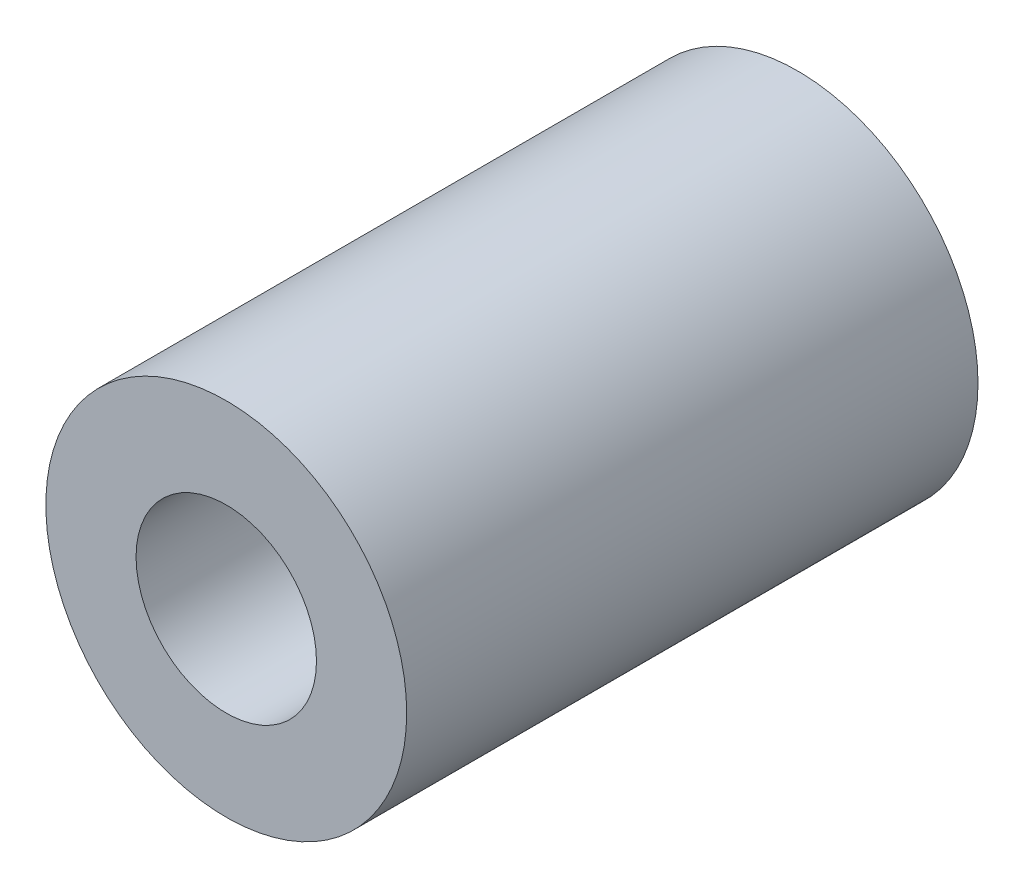
ISO-10303-21;
HEADER;
FILE_DESCRIPTION(('STEP AP214'),'2;1');
FILE_NAME('part.step','',(''),(''),'','','');
FILE_SCHEMA(('AUTOMOTIVE_DESIGN { 1 0 10303 214 1 1 1 1 }'));
ENDSEC;
DATA;
#1=APPLICATION_CONTEXT('core data for automotive mechanical design processes');
#2=APPLICATION_PROTOCOL_DEFINITION('international standard','automotive_design',2000,#1);
#3=PRODUCT_CONTEXT('',#1,'mechanical');
#4=PRODUCT('Part','Part','',(#3));
#5=PRODUCT_RELATED_PRODUCT_CATEGORY('part','',(#4));
#6=PRODUCT_DEFINITION_FORMATION('','',#4);
#7=PRODUCT_DEFINITION_CONTEXT('part definition',#1,'design');
#8=PRODUCT_DEFINITION('design','',#6,#7);
#9=PRODUCT_DEFINITION_SHAPE('','',#8);
#10=(LENGTH_UNIT() NAMED_UNIT(*) SI_UNIT(.MILLI.,.METRE.));
#11=(NAMED_UNIT(*) PLANE_ANGLE_UNIT() SI_UNIT($,.RADIAN.));
#12=(NAMED_UNIT(*) SI_UNIT($,.STERADIAN.) SOLID_ANGLE_UNIT());
#13=UNCERTAINTY_MEASURE_WITH_UNIT(LENGTH_MEASURE(1.E-05),#10,'distance_accuracy_value','');
#14=(GEOMETRIC_REPRESENTATION_CONTEXT(3) GLOBAL_UNCERTAINTY_ASSIGNED_CONTEXT((#13)) GLOBAL_UNIT_ASSIGNED_CONTEXT((#10,
#11,#12)) REPRESENTATION_CONTEXT('',''));
#15=CARTESIAN_POINT('',(0.,0.,0.));
#16=DIRECTION('',(0.,0.,1.));
#17=DIRECTION('',(1.,0.,0.));
#18=AXIS2_PLACEMENT_3D('',#15,#16,#17);
#19=CARTESIAN_POINT('',(0.,0.,19.));
#20=DIRECTION('',(0.,0.,1.));
#21=DIRECTION('',(1.,0.,0.));
#22=AXIS2_PLACEMENT_3D('',#19,#20,#21);
#23=PLANE('',#22);
#24=CARTESIAN_POINT('',(0.,0.,19.));
#25=DIRECTION('',(0.,0.,1.));
#26=DIRECTION('',(1.,0.,0.));
#27=AXIS2_PLACEMENT_3D('',#24,#25,#26);
#28=CIRCLE('',#27,6.);
#29=CARTESIAN_POINT('',(6.,0.,19.));
#30=VERTEX_POINT('',#29);
#31=EDGE_CURVE('E10',#30,#30,#28,.T.);
#32=ORIENTED_EDGE('',*,*,#31,.T.);
#33=EDGE_LOOP('',(#32));
#34=FACE_BOUND('',#33,.T.);
#35=CARTESIAN_POINT('',(0.,0.,19.));
#36=DIRECTION('',(0.,0.,1.));
#37=DIRECTION('',(1.,0.,0.));
#38=AXIS2_PLACEMENT_3D('',#35,#36,#37);
#39=CIRCLE('',#38,3.);
#40=CARTESIAN_POINT('',(3.,0.,19.));
#41=VERTEX_POINT('',#40);
#42=EDGE_CURVE('E44',#41,#41,#39,.T.);
#43=ORIENTED_EDGE('',*,*,#42,.F.);
#44=EDGE_LOOP('',(#43));
#45=FACE_BOUND('',#44,.T.);
#46=ADVANCED_FACE('F33',(#34,#45),#23,.T.);
#47=CARTESIAN_POINT('',(0.,0.,0.));
#48=DIRECTION('',(0.,0.,1.));
#49=DIRECTION('',(1.,0.,0.));
#50=AXIS2_PLACEMENT_3D('',#47,#48,#49);
#51=PLANE('',#50);
#52=CARTESIAN_POINT('',(0.,0.,0.));
#53=DIRECTION('',(0.,0.,1.));
#54=DIRECTION('',(1.,0.,0.));
#55=AXIS2_PLACEMENT_3D('',#52,#53,#54);
#56=CIRCLE('',#55,6.);
#57=CARTESIAN_POINT('',(6.,0.,0.));
#58=VERTEX_POINT('',#57);
#59=EDGE_CURVE('E37',#58,#58,#56,.T.);
#60=ORIENTED_EDGE('',*,*,#59,.F.);
#61=EDGE_LOOP('',(#60));
#62=FACE_BOUND('',#61,.T.);
#63=CARTESIAN_POINT('',(0.,0.,0.));
#64=DIRECTION('',(0.,0.,1.));
#65=DIRECTION('',(1.,0.,0.));
#66=AXIS2_PLACEMENT_3D('',#63,#64,#65);
#67=CIRCLE('',#66,3.);
#68=CARTESIAN_POINT('',(3.,0.,0.));
#69=VERTEX_POINT('',#68);
#70=EDGE_CURVE('E46',#69,#69,#67,.T.);
#71=ORIENTED_EDGE('',*,*,#70,.T.);
#72=EDGE_LOOP('',(#71));
#73=FACE_BOUND('',#72,.T.);
#74=ADVANCED_FACE('F56',(#62,#73),#51,.F.);
#75=CARTESIAN_POINT('',(0.,0.,19.));
#76=DIRECTION('',(0.,0.,-1.));
#77=DIRECTION('',(-1.,0.,0.));
#78=AXIS2_PLACEMENT_3D('',#75,#76,#77);
#79=CYLINDRICAL_SURFACE('',#78,6.);
#80=ORIENTED_EDGE('',*,*,#31,.F.);
#81=EDGE_LOOP('',(#80));
#82=FACE_BOUND('',#81,.T.);
#83=ORIENTED_EDGE('',*,*,#59,.T.);
#84=EDGE_LOOP('',(#83));
#85=FACE_BOUND('',#84,.T.);
#86=ADVANCED_FACE('F35',(#82,#85),#79,.T.);
#87=CARTESIAN_POINT('',(0.,0.,19.));
#88=DIRECTION('',(0.,0.,-1.));
#89=DIRECTION('',(-1.,0.,0.));
#90=AXIS2_PLACEMENT_3D('',#87,#88,#89);
#91=CYLINDRICAL_SURFACE('',#90,3.);
#92=ORIENTED_EDGE('',*,*,#42,.T.);
#93=EDGE_LOOP('',(#92));
#94=FACE_BOUND('',#93,.T.);
#95=ORIENTED_EDGE('',*,*,#70,.F.);
#96=EDGE_LOOP('',(#95));
#97=FACE_BOUND('',#96,.T.);
#98=ADVANCED_FACE('F52',(#94,#97),#91,.F.);
#99=CLOSED_SHELL('',(#46,#74,#86,#98));
#100=MANIFOLD_SOLID_BREP('B2',#99);
#101=ADVANCED_BREP_SHAPE_REPRESENTATION('',(#18,#100),#14);
#102=SHAPE_DEFINITION_REPRESENTATION(#9,#101);
ENDSEC;
END-ISO-10303-21;
